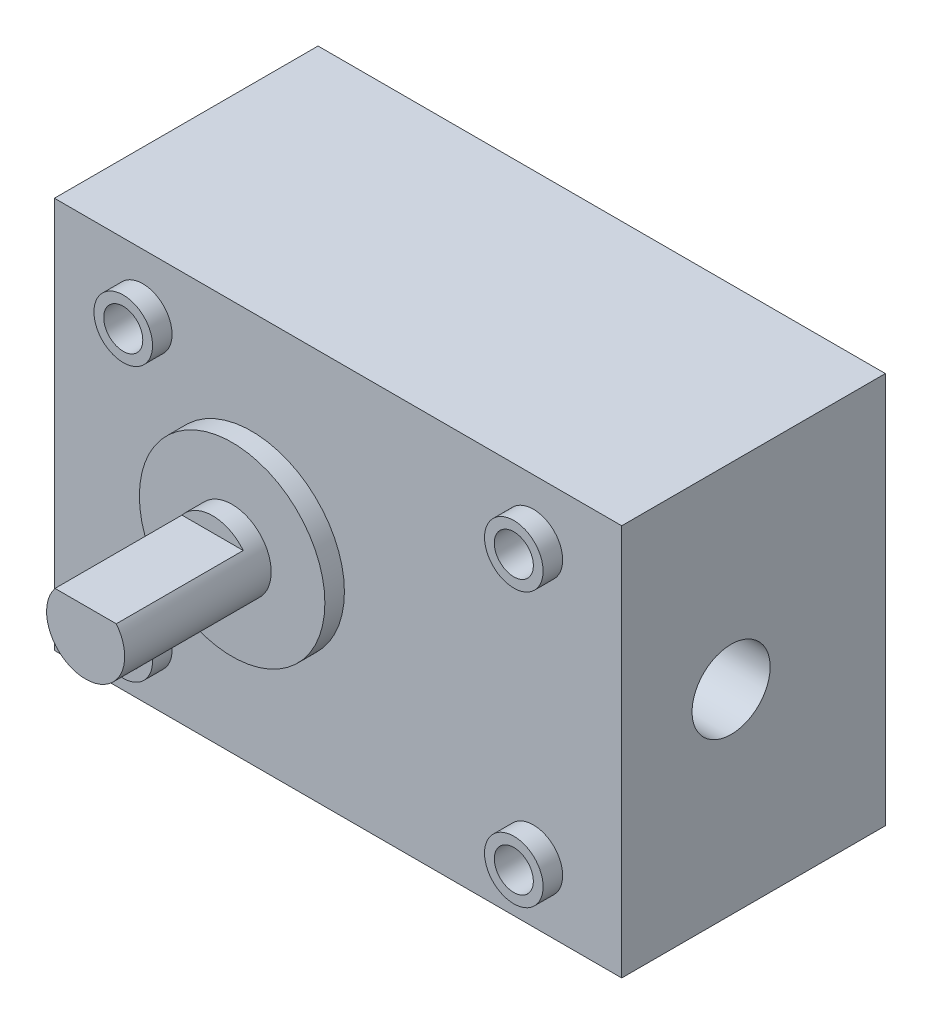
ISO-10303-21;
HEADER;
FILE_DESCRIPTION(('STEP AP214'),'2;1');
FILE_NAME('part.step','',(''),(''),'','','');
FILE_SCHEMA(('AUTOMOTIVE_DESIGN { 1 0 10303 214 1 1 1 1 }'));
ENDSEC;
DATA;
#1=APPLICATION_CONTEXT('core data for automotive mechanical design processes');
#2=APPLICATION_PROTOCOL_DEFINITION('international standard','automotive_design',2000,#1);
#3=PRODUCT_CONTEXT('',#1,'mechanical');
#4=PRODUCT('Part','Part','',(#3));
#5=PRODUCT_RELATED_PRODUCT_CATEGORY('part','',(#4));
#6=PRODUCT_DEFINITION_FORMATION('','',#4);
#7=PRODUCT_DEFINITION_CONTEXT('part definition',#1,'design');
#8=PRODUCT_DEFINITION('design','',#6,#7);
#9=PRODUCT_DEFINITION_SHAPE('','',#8);
#10=(LENGTH_UNIT() NAMED_UNIT(*) SI_UNIT(.MILLI.,.METRE.));
#11=(NAMED_UNIT(*) PLANE_ANGLE_UNIT() SI_UNIT($,.RADIAN.));
#12=(NAMED_UNIT(*) SI_UNIT($,.STERADIAN.) SOLID_ANGLE_UNIT());
#13=UNCERTAINTY_MEASURE_WITH_UNIT(LENGTH_MEASURE(1.E-05),#10,'distance_accuracy_value','');
#14=(GEOMETRIC_REPRESENTATION_CONTEXT(3) GLOBAL_UNCERTAINTY_ASSIGNED_CONTEXT((#13)) GLOBAL_UNIT_ASSIGNED_CONTEXT((#10,
#11,#12)) REPRESENTATION_CONTEXT('',''));
#15=CARTESIAN_POINT('',(0.,0.,0.));
#16=DIRECTION('',(0.,0.,1.));
#17=DIRECTION('',(1.,0.,0.));
#18=AXIS2_PLACEMENT_3D('',#15,#16,#17);
#19=CARTESIAN_POINT('',(0.,0.,27.));
#20=DIRECTION('',(1.,0.,0.));
#21=DIRECTION('',(0.,1.,0.));
#22=AXIS2_PLACEMENT_3D('',#19,#20,#21);
#23=PLANE('',#22);
#24=DIRECTION('',(0.,-1.,0.));
#25=VECTOR('',#24,1.);
#26=CARTESIAN_POINT('',(0.,0.,0.));
#27=LINE('',#26,#25);
#28=CARTESIAN_POINT('',(0.,40.11,0.));
#29=VERTEX_POINT('',#28);
#30=CARTESIAN_POINT('',(0.,0.,0.));
#31=VERTEX_POINT('',#30);
#32=EDGE_CURVE('E124',#29,#31,#27,.T.);
#33=ORIENTED_EDGE('',*,*,#32,.T.);
#34=DIRECTION('',(0.,0.,-1.));
#35=VECTOR('',#34,1.);
#36=CARTESIAN_POINT('',(0.,0.,27.));
#37=LINE('',#36,#35);
#38=CARTESIAN_POINT('',(0.,0.,27.));
#39=VERTEX_POINT('',#38);
#40=EDGE_CURVE('E127',#39,#31,#37,.T.);
#41=ORIENTED_EDGE('',*,*,#40,.F.);
#42=DIRECTION('',(0.,-1.,0.));
#43=VECTOR('',#42,1.);
#44=CARTESIAN_POINT('',(0.,0.,27.));
#45=LINE('',#44,#43);
#46=CARTESIAN_POINT('',(0.,40.11,27.));
#47=VERTEX_POINT('',#46);
#48=EDGE_CURVE('E128',#47,#39,#45,.T.);
#49=ORIENTED_EDGE('',*,*,#48,.F.);
#50=DIRECTION('',(0.,0.,-1.));
#51=VECTOR('',#50,1.);
#52=CARTESIAN_POINT('',(0.,40.11,27.));
#53=LINE('',#52,#51);
#54=EDGE_CURVE('E134',#47,#29,#53,.T.);
#55=ORIENTED_EDGE('',*,*,#54,.T.);
#56=EDGE_LOOP('',(#33,#41,#49,#55));
#57=FACE_BOUND('',#56,.T.);
#58=ADVANCED_FACE('F33',(#57),#23,.F.);
#59=CARTESIAN_POINT('',(0.,0.,27.));
#60=DIRECTION('',(0.,1.,0.));
#61=DIRECTION('',(0.,0.,1.));
#62=AXIS2_PLACEMENT_3D('',#59,#60,#61);
#63=PLANE('',#62);
#64=DIRECTION('',(1.,0.,0.));
#65=VECTOR('',#64,1.);
#66=CARTESIAN_POINT('',(0.,0.,0.));
#67=LINE('',#66,#65);
#68=CARTESIAN_POINT('',(58.1,0.,0.));
#69=VERTEX_POINT('',#68);
#70=EDGE_CURVE('E137',#31,#69,#67,.T.);
#71=ORIENTED_EDGE('',*,*,#70,.T.);
#72=DIRECTION('',(0.,0.,-1.));
#73=VECTOR('',#72,1.);
#74=CARTESIAN_POINT('',(58.1,0.,27.));
#75=LINE('',#74,#73);
#76=CARTESIAN_POINT('',(58.1,0.,27.));
#77=VERTEX_POINT('',#76);
#78=EDGE_CURVE('E145',#77,#69,#75,.T.);
#79=ORIENTED_EDGE('',*,*,#78,.F.);
#80=DIRECTION('',(1.,0.,0.));
#81=VECTOR('',#80,1.);
#82=CARTESIAN_POINT('',(0.,0.,27.));
#83=LINE('',#82,#81);
#84=EDGE_CURVE('E85',#39,#77,#83,.T.);
#85=ORIENTED_EDGE('',*,*,#84,.F.);
#86=ORIENTED_EDGE('',*,*,#40,.T.);
#87=EDGE_LOOP('',(#71,#79,#85,#86));
#88=FACE_BOUND('',#87,.T.);
#89=ADVANCED_FACE('F174',(#88),#63,.F.);
#90=CARTESIAN_POINT('',(58.1,0.,27.));
#91=DIRECTION('',(-1.,0.,0.));
#92=DIRECTION('',(0.,0.,1.));
#93=AXIS2_PLACEMENT_3D('',#90,#91,#92);
#94=PLANE('',#93);
#95=CARTESIAN_POINT('',(58.1,20.,15.7979111076917));
#96=DIRECTION('',(1.,0.,0.));
#97=DIRECTION('',(0.,0.,-1.));
#98=AXIS2_PLACEMENT_3D('',#95,#96,#97);
#99=CIRCLE('',#98,4.);
#100=CARTESIAN_POINT('',(58.1,20.,11.7979111076917));
#101=VERTEX_POINT('',#100);
#102=EDGE_CURVE('E490',#101,#101,#99,.T.);
#103=ORIENTED_EDGE('',*,*,#102,.F.);
#104=EDGE_LOOP('',(#103));
#105=FACE_BOUND('',#104,.T.);
#106=DIRECTION('',(0.,1.,0.));
#107=VECTOR('',#106,1.);
#108=CARTESIAN_POINT('',(58.1,0.,0.));
#109=LINE('',#108,#107);
#110=CARTESIAN_POINT('',(58.1,40.11,0.));
#111=VERTEX_POINT('',#110);
#112=EDGE_CURVE('E139',#69,#111,#109,.T.);
#113=ORIENTED_EDGE('',*,*,#112,.T.);
#114=DIRECTION('',(0.,0.,-1.));
#115=VECTOR('',#114,1.);
#116=CARTESIAN_POINT('',(58.1,40.11,27.));
#117=LINE('',#116,#115);
#118=CARTESIAN_POINT('',(58.1,40.11,27.));
#119=VERTEX_POINT('',#118);
#120=EDGE_CURVE('E143',#119,#111,#117,.T.);
#121=ORIENTED_EDGE('',*,*,#120,.F.);
#122=DIRECTION('',(0.,1.,0.));
#123=VECTOR('',#122,1.);
#124=CARTESIAN_POINT('',(58.1,0.,27.));
#125=LINE('',#124,#123);
#126=EDGE_CURVE('E131',#77,#119,#125,.T.);
#127=ORIENTED_EDGE('',*,*,#126,.F.);
#128=ORIENTED_EDGE('',*,*,#78,.T.);
#129=EDGE_LOOP('',(#113,#121,#127,#128));
#130=FACE_BOUND('',#129,.T.);
#131=ADVANCED_FACE('F179',(#105,#130),#94,.F.);
#132=CARTESIAN_POINT('',(0.,40.11,27.));
#133=DIRECTION('',(0.,-1.,0.));
#134=DIRECTION('',(0.,0.,-1.));
#135=AXIS2_PLACEMENT_3D('',#132,#133,#134);
#136=PLANE('',#135);
#137=DIRECTION('',(-1.,0.,0.));
#138=VECTOR('',#137,1.);
#139=CARTESIAN_POINT('',(0.,40.11,0.));
#140=LINE('',#139,#138);
#141=EDGE_CURVE('E77',#111,#29,#140,.T.);
#142=ORIENTED_EDGE('',*,*,#141,.T.);
#143=ORIENTED_EDGE('',*,*,#54,.F.);
#144=DIRECTION('',(-1.,0.,0.));
#145=VECTOR('',#144,1.);
#146=CARTESIAN_POINT('',(0.,40.11,27.));
#147=LINE('',#146,#145);
#148=EDGE_CURVE('E56',#119,#47,#147,.T.);
#149=ORIENTED_EDGE('',*,*,#148,.F.);
#150=ORIENTED_EDGE('',*,*,#120,.T.);
#151=EDGE_LOOP('',(#142,#143,#149,#150));
#152=FACE_BOUND('',#151,.T.);
#153=ADVANCED_FACE('F162',(#152),#136,.F.);
#154=CARTESIAN_POINT('',(0.,0.,27.));
#155=DIRECTION('',(0.,0.,-1.));
#156=DIRECTION('',(-1.,0.,0.));
#157=AXIS2_PLACEMENT_3D('',#154,#155,#156);
#158=PLANE('',#157);
#159=CARTESIAN_POINT('',(9.05,6.055,27.));
#160=DIRECTION('',(0.,0.,-1.));
#161=DIRECTION('',(-1.,0.,0.));
#162=AXIS2_PLACEMENT_3D('',#159,#160,#161);
#163=CIRCLE('',#162,3.);
#164=CARTESIAN_POINT('',(6.05,6.055,27.));
#165=VERTEX_POINT('',#164);
#166=EDGE_CURVE('E11',#165,#165,#163,.F.);
#167=ORIENTED_EDGE('',*,*,#166,.F.);
#168=EDGE_LOOP('',(#167));
#169=FACE_BOUND('',#168,.T.);
#170=CARTESIAN_POINT('',(49.05,6.05500000000001,27.));
#171=DIRECTION('',(0.,0.,-1.));
#172=DIRECTION('',(-1.,0.,0.));
#173=AXIS2_PLACEMENT_3D('',#170,#171,#172);
#174=CIRCLE('',#173,3.);
#175=CARTESIAN_POINT('',(46.05,6.05500000000001,27.));
#176=VERTEX_POINT('',#175);
#177=EDGE_CURVE('E40',#176,#176,#174,.F.);
#178=ORIENTED_EDGE('',*,*,#177,.F.);
#179=EDGE_LOOP('',(#178));
#180=FACE_BOUND('',#179,.T.);
#181=CARTESIAN_POINT('',(49.05,34.055,27.));
#182=DIRECTION('',(0.,0.,-1.));
#183=DIRECTION('',(-1.,0.,0.));
#184=AXIS2_PLACEMENT_3D('',#181,#182,#183);
#185=CIRCLE('',#184,3.);
#186=CARTESIAN_POINT('',(46.05,34.055,27.));
#187=VERTEX_POINT('',#186);
#188=EDGE_CURVE('E151',#187,#187,#185,.F.);
#189=ORIENTED_EDGE('',*,*,#188,.F.);
#190=EDGE_LOOP('',(#189));
#191=FACE_BOUND('',#190,.T.);
#192=CARTESIAN_POINT('',(9.05000000000001,34.055,27.));
#193=DIRECTION('',(0.,0.,-1.));
#194=DIRECTION('',(-1.,0.,0.));
#195=AXIS2_PLACEMENT_3D('',#192,#193,#194);
#196=CIRCLE('',#195,3.);
#197=CARTESIAN_POINT('',(6.05000000000001,34.055,27.));
#198=VERTEX_POINT('',#197);
#199=EDGE_CURVE('E101',#198,#198,#196,.F.);
#200=ORIENTED_EDGE('',*,*,#199,.F.);
#201=EDGE_LOOP('',(#200));
#202=FACE_BOUND('',#201,.T.);
#203=CARTESIAN_POINT('',(20.2,20.055,27.));
#204=DIRECTION('',(0.,0.,1.));
#205=DIRECTION('',(1.,0.,0.));
#206=AXIS2_PLACEMENT_3D('',#203,#204,#205);
#207=CIRCLE('',#206,9.5);
#208=CARTESIAN_POINT('',(29.7,20.055,27.));
#209=VERTEX_POINT('',#208);
#210=EDGE_CURVE('E121',#209,#209,#207,.T.);
#211=ORIENTED_EDGE('',*,*,#210,.F.);
#212=EDGE_LOOP('',(#211));
#213=FACE_BOUND('',#212,.T.);
#214=ORIENTED_EDGE('',*,*,#48,.T.);
#215=ORIENTED_EDGE('',*,*,#84,.T.);
#216=ORIENTED_EDGE('',*,*,#126,.T.);
#217=ORIENTED_EDGE('',*,*,#148,.T.);
#218=EDGE_LOOP('',(#214,#215,#216,#217));
#219=FACE_BOUND('',#218,.T.);
#220=ADVANCED_FACE('F158',(#169,#180,#191,#202,#213,#219),#158,.F.);
#221=CARTESIAN_POINT('',(0.,0.,0.));
#222=DIRECTION('',(0.,0.,-1.));
#223=DIRECTION('',(-1.,0.,0.));
#224=AXIS2_PLACEMENT_3D('',#221,#222,#223);
#225=PLANE('',#224);
#226=ORIENTED_EDGE('',*,*,#32,.F.);
#227=ORIENTED_EDGE('',*,*,#141,.F.);
#228=ORIENTED_EDGE('',*,*,#112,.F.);
#229=ORIENTED_EDGE('',*,*,#70,.F.);
#230=EDGE_LOOP('',(#226,#227,#228,#229));
#231=FACE_BOUND('',#230,.T.);
#232=ADVANCED_FACE('F161',(#231),#225,.T.);
#233=CARTESIAN_POINT('',(20.2,20.055,29.));
#234=DIRECTION('',(0.,0.,-1.));
#235=DIRECTION('',(-1.,0.,0.));
#236=AXIS2_PLACEMENT_3D('',#233,#234,#235);
#237=CYLINDRICAL_SURFACE('',#236,9.5);
#238=CARTESIAN_POINT('',(20.2,20.055,29.));
#239=DIRECTION('',(0.,0.,1.));
#240=DIRECTION('',(1.,0.,0.));
#241=AXIS2_PLACEMENT_3D('',#238,#239,#240);
#242=CIRCLE('',#241,9.5);
#243=CARTESIAN_POINT('',(29.7,20.055,29.));
#244=VERTEX_POINT('',#243);
#245=EDGE_CURVE('E118',#244,#244,#242,.T.);
#246=ORIENTED_EDGE('',*,*,#245,.F.);
#247=EDGE_LOOP('',(#246));
#248=FACE_BOUND('',#247,.T.);
#249=ORIENTED_EDGE('',*,*,#210,.T.);
#250=EDGE_LOOP('',(#249));
#251=FACE_BOUND('',#250,.T.);
#252=ADVANCED_FACE('F182',(#248,#251),#237,.T.);
#253=CARTESIAN_POINT('',(20.2,20.055,29.));
#254=DIRECTION('',(0.,0.,1.));
#255=DIRECTION('',(1.,0.,0.));
#256=AXIS2_PLACEMENT_3D('',#253,#254,#255);
#257=PLANE('',#256);
#258=CARTESIAN_POINT('',(20.2,20.055,29.));
#259=DIRECTION('',(0.,0.,1.));
#260=DIRECTION('',(1.,0.,0.));
#261=AXIS2_PLACEMENT_3D('',#258,#259,#260);
#262=CIRCLE('',#261,4.);
#263=CARTESIAN_POINT('',(24.2,20.055,29.));
#264=VERTEX_POINT('',#263);
#265=EDGE_CURVE('E102',#264,#264,#262,.T.);
#266=ORIENTED_EDGE('',*,*,#265,.F.);
#267=EDGE_LOOP('',(#266));
#268=FACE_BOUND('',#267,.T.);
#269=ORIENTED_EDGE('',*,*,#245,.T.);
#270=EDGE_LOOP('',(#269));
#271=FACE_BOUND('',#270,.T.);
#272=ADVANCED_FACE('F187',(#268,#271),#257,.T.);
#273=CARTESIAN_POINT('',(20.2,20.055,44.));
#274=DIRECTION('',(0.,0.,-1.));
#275=DIRECTION('',(-1.,0.,0.));
#276=AXIS2_PLACEMENT_3D('',#273,#274,#275);
#277=CYLINDRICAL_SURFACE('',#276,4.);
#278=CARTESIAN_POINT('',(20.2,20.055,44.));
#279=DIRECTION('',(0.,0.,1.));
#280=DIRECTION('',(1.,0.,0.));
#281=AXIS2_PLACEMENT_3D('',#278,#279,#280);
#282=CIRCLE('',#281,4.);
#283=CARTESIAN_POINT('',(17.0615619407535,22.534960997329,44.));
#284=VERTEX_POINT('',#283);
#285=CARTESIAN_POINT('',(23.3384380592465,22.534960997329,44.));
#286=VERTEX_POINT('',#285);
#287=EDGE_CURVE('E112',#284,#286,#282,.T.);
#288=ORIENTED_EDGE('',*,*,#287,.F.);
#289=DIRECTION('',(0.,0.,1.));
#290=VECTOR('',#289,1.);
#291=CARTESIAN_POINT('',(17.0615619407535,22.534960997329,31.));
#292=LINE('',#291,#290);
#293=CARTESIAN_POINT('',(17.0615619407535,22.534960997329,31.));
#294=VERTEX_POINT('',#293);
#295=EDGE_CURVE('E47',#294,#284,#292,.T.);
#296=ORIENTED_EDGE('',*,*,#295,.F.);
#297=CARTESIAN_POINT('',(20.2,20.055,31.));
#298=DIRECTION('',(0.,0.,1.));
#299=DIRECTION('',(1.,0.,0.));
#300=AXIS2_PLACEMENT_3D('',#297,#298,#299);
#301=CIRCLE('',#300,4.);
#302=CARTESIAN_POINT('',(23.3384380592465,22.534960997329,31.));
#303=VERTEX_POINT('',#302);
#304=EDGE_CURVE('E96',#303,#294,#301,.T.);
#305=ORIENTED_EDGE('',*,*,#304,.F.);
#306=DIRECTION('',(0.,0.,1.));
#307=VECTOR('',#306,1.);
#308=CARTESIAN_POINT('',(23.3384380592465,22.534960997329,31.));
#309=LINE('',#308,#307);
#310=EDGE_CURVE('E105',#303,#286,#309,.T.);
#311=ORIENTED_EDGE('',*,*,#310,.T.);
#312=EDGE_LOOP('',(#288,#296,#305,#311));
#313=FACE_BOUND('',#312,.T.);
#314=ORIENTED_EDGE('',*,*,#265,.T.);
#315=EDGE_LOOP('',(#314));
#316=FACE_BOUND('',#315,.T.);
#317=ADVANCED_FACE('F109',(#313,#316),#277,.T.);
#318=CARTESIAN_POINT('',(20.2,20.055,44.));
#319=DIRECTION('',(0.,0.,1.));
#320=DIRECTION('',(1.,0.,0.));
#321=AXIS2_PLACEMENT_3D('',#318,#319,#320);
#322=PLANE('',#321);
#323=DIRECTION('',(1.,0.,0.));
#324=VECTOR('',#323,1.);
#325=CARTESIAN_POINT('',(17.0615619407535,22.534960997329,44.));
#326=LINE('',#325,#324);
#327=EDGE_CURVE('E106',#284,#286,#326,.T.);
#328=ORIENTED_EDGE('',*,*,#327,.F.);
#329=ORIENTED_EDGE('',*,*,#287,.T.);
#330=EDGE_LOOP('',(#328,#329));
#331=FACE_BOUND('',#330,.T.);
#332=ADVANCED_FACE('F404',(#331),#322,.T.);
#333=CARTESIAN_POINT('',(0.,0.,31.));
#334=DIRECTION('',(0.,0.,1.));
#335=DIRECTION('',(1.,0.,0.));
#336=AXIS2_PLACEMENT_3D('',#333,#334,#335);
#337=PLANE('',#336);
#338=ORIENTED_EDGE('',*,*,#304,.T.);
#339=DIRECTION('',(1.,0.,0.));
#340=VECTOR('',#339,1.);
#341=CARTESIAN_POINT('',(17.0615619407535,22.534960997329,31.));
#342=LINE('',#341,#340);
#343=EDGE_CURVE('E98',#294,#303,#342,.T.);
#344=ORIENTED_EDGE('',*,*,#343,.T.);
#345=EDGE_LOOP('',(#338,#344));
#346=FACE_BOUND('',#345,.T.);
#347=ADVANCED_FACE('F97',(#346),#337,.T.);
#348=CARTESIAN_POINT('',(17.0615619407535,22.534960997329,31.));
#349=DIRECTION('',(0.,-1.,0.));
#350=DIRECTION('',(0.,0.,-1.));
#351=AXIS2_PLACEMENT_3D('',#348,#349,#350);
#352=PLANE('',#351);
#353=ORIENTED_EDGE('',*,*,#327,.T.);
#354=ORIENTED_EDGE('',*,*,#310,.F.);
#355=ORIENTED_EDGE('',*,*,#343,.F.);
#356=ORIENTED_EDGE('',*,*,#295,.T.);
#357=EDGE_LOOP('',(#353,#354,#355,#356));
#358=FACE_BOUND('',#357,.T.);
#359=ADVANCED_FACE('F104',(#358),#352,.F.);
#360=CARTESIAN_POINT('',(9.05000000000001,34.055,29.));
#361=DIRECTION('',(0.,0.,-1.));
#362=DIRECTION('',(-1.,0.,0.));
#363=AXIS2_PLACEMENT_3D('',#360,#361,#362);
#364=CYLINDRICAL_SURFACE('',#363,3.);
#365=CARTESIAN_POINT('',(9.05000000000001,34.055,29.));
#366=DIRECTION('',(0.,0.,1.));
#367=DIRECTION('',(1.,0.,0.));
#368=AXIS2_PLACEMENT_3D('',#365,#366,#367);
#369=CIRCLE('',#368,3.);
#370=CARTESIAN_POINT('',(12.05,34.055,29.));
#371=VERTEX_POINT('',#370);
#372=EDGE_CURVE('E452',#371,#371,#369,.T.);
#373=ORIENTED_EDGE('',*,*,#372,.F.);
#374=EDGE_LOOP('',(#373));
#375=FACE_BOUND('',#374,.T.);
#376=ORIENTED_EDGE('',*,*,#199,.T.);
#377=EDGE_LOOP('',(#376));
#378=FACE_BOUND('',#377,.T.);
#379=ADVANCED_FACE('F221',(#375,#378),#364,.T.);
#380=CARTESIAN_POINT('',(9.05000000000001,34.055,29.));
#381=DIRECTION('',(0.,0.,1.));
#382=DIRECTION('',(1.,0.,0.));
#383=AXIS2_PLACEMENT_3D('',#380,#381,#382);
#384=PLANE('',#383);
#385=CARTESIAN_POINT('',(9.05000000000001,34.055,29.));
#386=DIRECTION('',(0.,0.,1.));
#387=DIRECTION('',(1.,0.,0.));
#388=AXIS2_PLACEMENT_3D('',#385,#386,#387);
#389=CIRCLE('',#388,2.);
#390=CARTESIAN_POINT('',(11.05,34.055,29.));
#391=VERTEX_POINT('',#390);
#392=EDGE_CURVE('E466',#391,#391,#389,.T.);
#393=ORIENTED_EDGE('',*,*,#392,.F.);
#394=EDGE_LOOP('',(#393));
#395=FACE_BOUND('',#394,.T.);
#396=ORIENTED_EDGE('',*,*,#372,.T.);
#397=EDGE_LOOP('',(#396));
#398=FACE_BOUND('',#397,.T.);
#399=ADVANCED_FACE('F226',(#395,#398),#384,.T.);
#400=CARTESIAN_POINT('',(49.05,34.055,29.));
#401=DIRECTION('',(0.,0.,-1.));
#402=DIRECTION('',(-1.,0.,0.));
#403=AXIS2_PLACEMENT_3D('',#400,#401,#402);
#404=CYLINDRICAL_SURFACE('',#403,3.);
#405=CARTESIAN_POINT('',(49.05,34.055,29.));
#406=DIRECTION('',(0.,0.,1.));
#407=DIRECTION('',(-1.,0.,0.));
#408=AXIS2_PLACEMENT_3D('',#405,#406,#407);
#409=CIRCLE('',#408,3.);
#410=CARTESIAN_POINT('',(46.05,34.055,29.));
#411=VERTEX_POINT('',#410);
#412=EDGE_CURVE('E454',#411,#411,#409,.T.);
#413=ORIENTED_EDGE('',*,*,#412,.F.);
#414=EDGE_LOOP('',(#413));
#415=FACE_BOUND('',#414,.T.);
#416=ORIENTED_EDGE('',*,*,#188,.T.);
#417=EDGE_LOOP('',(#416));
#418=FACE_BOUND('',#417,.T.);
#419=ADVANCED_FACE('F234',(#415,#418),#404,.T.);
#420=CARTESIAN_POINT('',(49.05,34.055,29.));
#421=DIRECTION('',(0.,0.,-1.));
#422=DIRECTION('',(-1.,0.,0.));
#423=AXIS2_PLACEMENT_3D('',#420,#421,#422);
#424=PLANE('',#423);
#425=CARTESIAN_POINT('',(49.05,34.055,29.));
#426=DIRECTION('',(0.,0.,1.));
#427=DIRECTION('',(1.,0.,0.));
#428=AXIS2_PLACEMENT_3D('',#425,#426,#427);
#429=CIRCLE('',#428,2.);
#430=CARTESIAN_POINT('',(51.05,34.055,29.));
#431=VERTEX_POINT('',#430);
#432=EDGE_CURVE('E485',#431,#431,#429,.T.);
#433=ORIENTED_EDGE('',*,*,#432,.F.);
#434=EDGE_LOOP('',(#433));
#435=FACE_BOUND('',#434,.T.);
#436=ORIENTED_EDGE('',*,*,#412,.T.);
#437=EDGE_LOOP('',(#436));
#438=FACE_BOUND('',#437,.T.);
#439=ADVANCED_FACE('F239',(#435,#438),#424,.F.);
#440=CARTESIAN_POINT('',(49.05,6.05500000000001,29.));
#441=DIRECTION('',(0.,0.,-1.));
#442=DIRECTION('',(-1.,0.,0.));
#443=AXIS2_PLACEMENT_3D('',#440,#441,#442);
#444=CYLINDRICAL_SURFACE('',#443,3.);
#445=CARTESIAN_POINT('',(49.05,6.05500000000001,29.));
#446=DIRECTION('',(0.,0.,1.));
#447=DIRECTION('',(1.,0.,0.));
#448=AXIS2_PLACEMENT_3D('',#445,#446,#447);
#449=CIRCLE('',#448,3.);
#450=CARTESIAN_POINT('',(52.05,6.05500000000001,29.));
#451=VERTEX_POINT('',#450);
#452=EDGE_CURVE('E459',#451,#451,#449,.T.);
#453=ORIENTED_EDGE('',*,*,#452,.F.);
#454=EDGE_LOOP('',(#453));
#455=FACE_BOUND('',#454,.T.);
#456=ORIENTED_EDGE('',*,*,#177,.T.);
#457=EDGE_LOOP('',(#456));
#458=FACE_BOUND('',#457,.T.);
#459=ADVANCED_FACE('F156',(#455,#458),#444,.T.);
#460=CARTESIAN_POINT('',(49.05,6.05500000000001,29.));
#461=DIRECTION('',(0.,0.,1.));
#462=DIRECTION('',(1.,0.,0.));
#463=AXIS2_PLACEMENT_3D('',#460,#461,#462);
#464=PLANE('',#463);
#465=CARTESIAN_POINT('',(49.05,6.05500000000001,29.));
#466=DIRECTION('',(0.,0.,1.));
#467=DIRECTION('',(1.,0.,0.));
#468=AXIS2_PLACEMENT_3D('',#465,#466,#467);
#469=CIRCLE('',#468,2.);
#470=CARTESIAN_POINT('',(51.05,6.05500000000001,29.));
#471=VERTEX_POINT('',#470);
#472=EDGE_CURVE('E479',#471,#471,#469,.T.);
#473=ORIENTED_EDGE('',*,*,#472,.F.);
#474=EDGE_LOOP('',(#473));
#475=FACE_BOUND('',#474,.T.);
#476=ORIENTED_EDGE('',*,*,#452,.T.);
#477=EDGE_LOOP('',(#476));
#478=FACE_BOUND('',#477,.T.);
#479=ADVANCED_FACE('F251',(#475,#478),#464,.T.);
#480=CARTESIAN_POINT('',(9.05,6.055,29.));
#481=DIRECTION('',(0.,0.,-1.));
#482=DIRECTION('',(-1.,0.,0.));
#483=AXIS2_PLACEMENT_3D('',#480,#481,#482);
#484=CYLINDRICAL_SURFACE('',#483,3.);
#485=CARTESIAN_POINT('',(9.05,6.055,29.));
#486=DIRECTION('',(0.,0.,1.));
#487=DIRECTION('',(-1.,0.,0.));
#488=AXIS2_PLACEMENT_3D('',#485,#486,#487);
#489=CIRCLE('',#488,3.);
#490=CARTESIAN_POINT('',(6.05,6.055,29.));
#491=VERTEX_POINT('',#490);
#492=EDGE_CURVE('E462',#491,#491,#489,.T.);
#493=ORIENTED_EDGE('',*,*,#492,.F.);
#494=EDGE_LOOP('',(#493));
#495=FACE_BOUND('',#494,.T.);
#496=ORIENTED_EDGE('',*,*,#166,.T.);
#497=EDGE_LOOP('',(#496));
#498=FACE_BOUND('',#497,.T.);
#499=ADVANCED_FACE('F259',(#495,#498),#484,.T.);
#500=CARTESIAN_POINT('',(9.05,6.055,29.));
#501=DIRECTION('',(0.,0.,-1.));
#502=DIRECTION('',(-1.,0.,0.));
#503=AXIS2_PLACEMENT_3D('',#500,#501,#502);
#504=PLANE('',#503);
#505=CARTESIAN_POINT('',(9.05,6.055,29.));
#506=DIRECTION('',(0.,0.,1.));
#507=DIRECTION('',(1.,0.,0.));
#508=AXIS2_PLACEMENT_3D('',#505,#506,#507);
#509=CIRCLE('',#508,2.);
#510=CARTESIAN_POINT('',(11.05,6.055,29.));
#511=VERTEX_POINT('',#510);
#512=EDGE_CURVE('E472',#511,#511,#509,.T.);
#513=ORIENTED_EDGE('',*,*,#512,.F.);
#514=EDGE_LOOP('',(#513));
#515=FACE_BOUND('',#514,.T.);
#516=ORIENTED_EDGE('',*,*,#492,.T.);
#517=EDGE_LOOP('',(#516));
#518=FACE_BOUND('',#517,.T.);
#519=ADVANCED_FACE('F264',(#515,#518),#504,.F.);
#520=CARTESIAN_POINT('',(9.05,6.055,21.));
#521=DIRECTION('',(0.,0.,1.));
#522=DIRECTION('',(1.,0.,0.));
#523=AXIS2_PLACEMENT_3D('',#520,#521,#522);
#524=CYLINDRICAL_SURFACE('',#523,2.);
#525=CARTESIAN_POINT('',(9.05,6.055,21.));
#526=DIRECTION('',(0.,0.,1.));
#527=DIRECTION('',(1.,0.,0.));
#528=AXIS2_PLACEMENT_3D('',#525,#526,#527);
#529=CIRCLE('',#528,2.);
#530=CARTESIAN_POINT('',(11.05,6.055,21.));
#531=VERTEX_POINT('',#530);
#532=EDGE_CURVE('E475',#531,#531,#529,.T.);
#533=ORIENTED_EDGE('',*,*,#532,.F.);
#534=EDGE_LOOP('',(#533));
#535=FACE_BOUND('',#534,.T.);
#536=ORIENTED_EDGE('',*,*,#512,.T.);
#537=EDGE_LOOP('',(#536));
#538=FACE_BOUND('',#537,.T.);
#539=ADVANCED_FACE('F295',(#535,#538),#524,.F.);
#540=CARTESIAN_POINT('',(9.05,6.055,21.));
#541=DIRECTION('',(0.,0.,1.));
#542=DIRECTION('',(1.,0.,0.));
#543=AXIS2_PLACEMENT_3D('',#540,#541,#542);
#544=PLANE('',#543);
#545=ORIENTED_EDGE('',*,*,#532,.T.);
#546=EDGE_LOOP('',(#545));
#547=FACE_BOUND('',#546,.T.);
#548=ADVANCED_FACE('F305',(#547),#544,.T.);
#549=CARTESIAN_POINT('',(49.05,6.05500000000001,21.));
#550=DIRECTION('',(0.,0.,1.));
#551=DIRECTION('',(1.,0.,0.));
#552=AXIS2_PLACEMENT_3D('',#549,#550,#551);
#553=CYLINDRICAL_SURFACE('',#552,2.);
#554=CARTESIAN_POINT('',(49.05,6.05500000000001,21.));
#555=DIRECTION('',(0.,0.,1.));
#556=DIRECTION('',(1.,0.,0.));
#557=AXIS2_PLACEMENT_3D('',#554,#555,#556);
#558=CIRCLE('',#557,2.);
#559=CARTESIAN_POINT('',(51.05,6.05500000000001,21.));
#560=VERTEX_POINT('',#559);
#561=EDGE_CURVE('E482',#560,#560,#558,.T.);
#562=ORIENTED_EDGE('',*,*,#561,.F.);
#563=EDGE_LOOP('',(#562));
#564=FACE_BOUND('',#563,.T.);
#565=ORIENTED_EDGE('',*,*,#472,.T.);
#566=EDGE_LOOP('',(#565));
#567=FACE_BOUND('',#566,.T.);
#568=ADVANCED_FACE('F315',(#564,#567),#553,.F.);
#569=CARTESIAN_POINT('',(49.05,6.05500000000001,21.));
#570=DIRECTION('',(0.,0.,1.));
#571=DIRECTION('',(1.,0.,0.));
#572=AXIS2_PLACEMENT_3D('',#569,#570,#571);
#573=PLANE('',#572);
#574=ORIENTED_EDGE('',*,*,#561,.T.);
#575=EDGE_LOOP('',(#574));
#576=FACE_BOUND('',#575,.T.);
#577=ADVANCED_FACE('F325',(#576),#573,.T.);
#578=CARTESIAN_POINT('',(49.05,34.055,21.));
#579=DIRECTION('',(0.,0.,1.));
#580=DIRECTION('',(1.,0.,0.));
#581=AXIS2_PLACEMENT_3D('',#578,#579,#580);
#582=CYLINDRICAL_SURFACE('',#581,2.);
#583=CARTESIAN_POINT('',(49.05,34.055,21.));
#584=DIRECTION('',(0.,0.,1.));
#585=DIRECTION('',(1.,0.,0.));
#586=AXIS2_PLACEMENT_3D('',#583,#584,#585);
#587=CIRCLE('',#586,2.);
#588=CARTESIAN_POINT('',(51.05,34.055,21.));
#589=VERTEX_POINT('',#588);
#590=EDGE_CURVE('E469',#589,#589,#587,.T.);
#591=ORIENTED_EDGE('',*,*,#590,.F.);
#592=EDGE_LOOP('',(#591));
#593=FACE_BOUND('',#592,.T.);
#594=ORIENTED_EDGE('',*,*,#432,.T.);
#595=EDGE_LOOP('',(#594));
#596=FACE_BOUND('',#595,.T.);
#597=ADVANCED_FACE('F335',(#593,#596),#582,.F.);
#598=CARTESIAN_POINT('',(49.05,34.055,21.));
#599=DIRECTION('',(0.,0.,1.));
#600=DIRECTION('',(1.,0.,0.));
#601=AXIS2_PLACEMENT_3D('',#598,#599,#600);
#602=PLANE('',#601);
#603=ORIENTED_EDGE('',*,*,#590,.T.);
#604=EDGE_LOOP('',(#603));
#605=FACE_BOUND('',#604,.T.);
#606=ADVANCED_FACE('F345',(#605),#602,.T.);
#607=CARTESIAN_POINT('',(9.05000000000001,34.055,21.));
#608=DIRECTION('',(0.,0.,1.));
#609=DIRECTION('',(1.,0.,0.));
#610=AXIS2_PLACEMENT_3D('',#607,#608,#609);
#611=CYLINDRICAL_SURFACE('',#610,2.);
#612=CARTESIAN_POINT('',(9.05000000000001,34.055,21.));
#613=DIRECTION('',(0.,0.,1.));
#614=DIRECTION('',(1.,0.,0.));
#615=AXIS2_PLACEMENT_3D('',#612,#613,#614);
#616=CIRCLE('',#615,2.);
#617=CARTESIAN_POINT('',(11.05,34.055,21.));
#618=VERTEX_POINT('',#617);
#619=EDGE_CURVE('E465',#618,#618,#616,.T.);
#620=ORIENTED_EDGE('',*,*,#619,.F.);
#621=EDGE_LOOP('',(#620));
#622=FACE_BOUND('',#621,.T.);
#623=ORIENTED_EDGE('',*,*,#392,.T.);
#624=EDGE_LOOP('',(#623));
#625=FACE_BOUND('',#624,.T.);
#626=ADVANCED_FACE('F355',(#622,#625),#611,.F.);
#627=CARTESIAN_POINT('',(9.05000000000001,34.055,21.));
#628=DIRECTION('',(0.,0.,1.));
#629=DIRECTION('',(1.,0.,0.));
#630=AXIS2_PLACEMENT_3D('',#627,#628,#629);
#631=PLANE('',#630);
#632=ORIENTED_EDGE('',*,*,#619,.T.);
#633=EDGE_LOOP('',(#632));
#634=FACE_BOUND('',#633,.T.);
#635=ADVANCED_FACE('F365',(#634),#631,.T.);
#636=CARTESIAN_POINT('',(32.7,20.,15.7979111076917));
#637=DIRECTION('',(1.,0.,0.));
#638=DIRECTION('',(0.,0.,-1.));
#639=AXIS2_PLACEMENT_3D('',#636,#637,#638);
#640=CYLINDRICAL_SURFACE('',#639,4.);
#641=CARTESIAN_POINT('',(32.7,20.,15.7979111076917));
#642=DIRECTION('',(1.,0.,0.));
#643=DIRECTION('',(0.,0.,-1.));
#644=AXIS2_PLACEMENT_3D('',#641,#642,#643);
#645=CIRCLE('',#644,4.);
#646=CARTESIAN_POINT('',(32.7,20.,11.7979111076917));
#647=VERTEX_POINT('',#646);
#648=EDGE_CURVE('E476',#647,#647,#645,.T.);
#649=ORIENTED_EDGE('',*,*,#648,.F.);
#650=EDGE_LOOP('',(#649));
#651=FACE_BOUND('',#650,.T.);
#652=ORIENTED_EDGE('',*,*,#102,.T.);
#653=EDGE_LOOP('',(#652));
#654=FACE_BOUND('',#653,.T.);
#655=ADVANCED_FACE('F374',(#651,#654),#640,.F.);
#656=CARTESIAN_POINT('',(32.7,20.,15.7979111076917));
#657=DIRECTION('',(1.,0.,0.));
#658=DIRECTION('',(0.,0.,-1.));
#659=AXIS2_PLACEMENT_3D('',#656,#657,#658);
#660=PLANE('',#659);
#661=ORIENTED_EDGE('',*,*,#648,.T.);
#662=EDGE_LOOP('',(#661));
#663=FACE_BOUND('',#662,.T.);
#664=ADVANCED_FACE('F386',(#663),#660,.T.);
#665=CLOSED_SHELL('',(#58,#89,#131,#153,#220,#232,#252,#272,#317,#332,#347,#359,#379,#399,#419,
#439,#459,#479,#499,#519,#539,#548,#568,#577,#597,#606,#626,#635,#655,#664));
#666=MANIFOLD_SOLID_BREP('B2',#665);
#667=ADVANCED_BREP_SHAPE_REPRESENTATION('',(#18,#666),#14);
#668=SHAPE_DEFINITION_REPRESENTATION(#9,#667);
ENDSEC;
END-ISO-10303-21;
